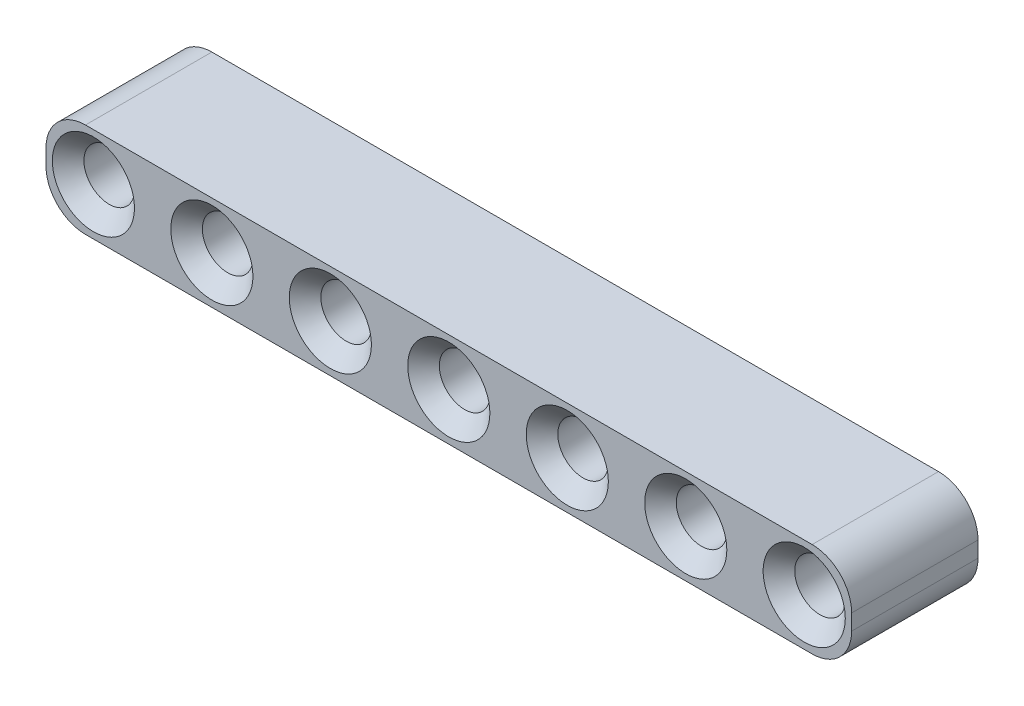
ISO-10303-21;
HEADER;
FILE_DESCRIPTION(('STEP AP214'),'2;1');
FILE_NAME('part.step','',(''),(''),'','','');
FILE_SCHEMA(('AUTOMOTIVE_DESIGN { 1 0 10303 214 1 1 1 1 }'));
ENDSEC;
DATA;
#1=APPLICATION_CONTEXT('core data for automotive mechanical design processes');
#2=APPLICATION_PROTOCOL_DEFINITION('international standard','automotive_design',2000,#1);
#3=PRODUCT_CONTEXT('',#1,'mechanical');
#4=PRODUCT('Part','Part','',(#3));
#5=PRODUCT_RELATED_PRODUCT_CATEGORY('part','',(#4));
#6=PRODUCT_DEFINITION_FORMATION('','',#4);
#7=PRODUCT_DEFINITION_CONTEXT('part definition',#1,'design');
#8=PRODUCT_DEFINITION('design','',#6,#7);
#9=PRODUCT_DEFINITION_SHAPE('','',#8);
#10=(LENGTH_UNIT() NAMED_UNIT(*) SI_UNIT(.MILLI.,.METRE.));
#11=(NAMED_UNIT(*) PLANE_ANGLE_UNIT() SI_UNIT($,.RADIAN.));
#12=(NAMED_UNIT(*) SI_UNIT($,.STERADIAN.) SOLID_ANGLE_UNIT());
#13=UNCERTAINTY_MEASURE_WITH_UNIT(LENGTH_MEASURE(1.E-05),#10,'distance_accuracy_value','');
#14=(GEOMETRIC_REPRESENTATION_CONTEXT(3) GLOBAL_UNCERTAINTY_ASSIGNED_CONTEXT((#13)) GLOBAL_UNIT_ASSIGNED_CONTEXT((#10,
#11,#12)) REPRESENTATION_CONTEXT('',''));
#15=CARTESIAN_POINT('',(0.,0.,0.));
#16=DIRECTION('',(0.,0.,1.));
#17=DIRECTION('',(1.,0.,0.));
#18=AXIS2_PLACEMENT_3D('',#15,#16,#17);
#19=CARTESIAN_POINT('',(45.5,-0.5,8.));
#20=DIRECTION('',(0.,0.,1.));
#21=DIRECTION('',(1.,0.,0.));
#22=AXIS2_PLACEMENT_3D('',#19,#20,#21);
#23=PLANE('',#22);
#24=CARTESIAN_POINT('',(45.,0.,8.));
#25=DIRECTION('',(0.,0.,1.));
#26=DIRECTION('',(1.,0.,0.));
#27=AXIS2_PLACEMENT_3D('',#24,#25,#26);
#28=CIRCLE('',#27,2.6);
#29=CARTESIAN_POINT('',(47.6,0.,8.));
#30=VERTEX_POINT('',#29);
#31=EDGE_CURVE('E204',#30,#30,#28,.F.);
#32=ORIENTED_EDGE('',*,*,#31,.T.);
#33=EDGE_LOOP('',(#32));
#34=FACE_BOUND('',#33,.T.);
#35=CARTESIAN_POINT('',(37.5,0.,8.));
#36=DIRECTION('',(0.,0.,1.));
#37=DIRECTION('',(1.,0.,0.));
#38=AXIS2_PLACEMENT_3D('',#35,#36,#37);
#39=CIRCLE('',#38,2.6);
#40=CARTESIAN_POINT('',(40.1,0.,8.));
#41=VERTEX_POINT('',#40);
#42=EDGE_CURVE('E201',#41,#41,#39,.F.);
#43=ORIENTED_EDGE('',*,*,#42,.T.);
#44=EDGE_LOOP('',(#43));
#45=FACE_BOUND('',#44,.T.);
#46=CARTESIAN_POINT('',(30.,0.,8.));
#47=DIRECTION('',(0.,0.,1.));
#48=DIRECTION('',(1.,0.,0.));
#49=AXIS2_PLACEMENT_3D('',#46,#47,#48);
#50=CIRCLE('',#49,2.6);
#51=CARTESIAN_POINT('',(32.6,0.,8.));
#52=VERTEX_POINT('',#51);
#53=EDGE_CURVE('E198',#52,#52,#50,.F.);
#54=ORIENTED_EDGE('',*,*,#53,.T.);
#55=EDGE_LOOP('',(#54));
#56=FACE_BOUND('',#55,.T.);
#57=CARTESIAN_POINT('',(22.5,0.,8.));
#58=DIRECTION('',(0.,0.,1.));
#59=DIRECTION('',(1.,0.,0.));
#60=AXIS2_PLACEMENT_3D('',#57,#58,#59);
#61=CIRCLE('',#60,2.6);
#62=CARTESIAN_POINT('',(25.1,0.,8.));
#63=VERTEX_POINT('',#62);
#64=EDGE_CURVE('E195',#63,#63,#61,.F.);
#65=ORIENTED_EDGE('',*,*,#64,.T.);
#66=EDGE_LOOP('',(#65));
#67=FACE_BOUND('',#66,.T.);
#68=CARTESIAN_POINT('',(15.,0.,8.));
#69=DIRECTION('',(0.,0.,1.));
#70=DIRECTION('',(1.,0.,0.));
#71=AXIS2_PLACEMENT_3D('',#68,#69,#70);
#72=CIRCLE('',#71,2.6);
#73=CARTESIAN_POINT('',(17.6,0.,8.));
#74=VERTEX_POINT('',#73);
#75=EDGE_CURVE('E192',#74,#74,#72,.F.);
#76=ORIENTED_EDGE('',*,*,#75,.T.);
#77=EDGE_LOOP('',(#76));
#78=FACE_BOUND('',#77,.T.);
#79=CARTESIAN_POINT('',(7.5,0.,8.));
#80=DIRECTION('',(0.,0.,1.));
#81=DIRECTION('',(1.,0.,0.));
#82=AXIS2_PLACEMENT_3D('',#79,#80,#81);
#83=CIRCLE('',#82,2.60000000000001);
#84=CARTESIAN_POINT('',(10.1,0.,8.));
#85=VERTEX_POINT('',#84);
#86=EDGE_CURVE('E189',#85,#85,#83,.F.);
#87=ORIENTED_EDGE('',*,*,#86,.T.);
#88=EDGE_LOOP('',(#87));
#89=FACE_BOUND('',#88,.T.);
#90=CARTESIAN_POINT('',(0.,0.,8.));
#91=DIRECTION('',(0.,0.,1.));
#92=DIRECTION('',(1.,0.,0.));
#93=AXIS2_PLACEMENT_3D('',#90,#91,#92);
#94=CIRCLE('',#93,2.60000000000001);
#95=CARTESIAN_POINT('',(2.60000000000001,0.,8.));
#96=VERTEX_POINT('',#95);
#97=EDGE_CURVE('E186',#96,#96,#94,.F.);
#98=ORIENTED_EDGE('',*,*,#97,.T.);
#99=EDGE_LOOP('',(#98));
#100=FACE_BOUND('',#99,.T.);
#101=CARTESIAN_POINT('',(45.5,-0.5,8.));
#102=DIRECTION('',(0.,0.,1.));
#103=DIRECTION('',(1.,0.,0.));
#104=AXIS2_PLACEMENT_3D('',#101,#102,#103);
#105=CIRCLE('',#104,2.5);
#106=CARTESIAN_POINT('',(45.5,-3.,8.));
#107=VERTEX_POINT('',#106);
#108=CARTESIAN_POINT('',(48.,-0.5,8.));
#109=VERTEX_POINT('',#108);
#110=EDGE_CURVE('E144',#107,#109,#105,.T.);
#111=ORIENTED_EDGE('',*,*,#110,.T.);
#112=DIRECTION('',(0.,1.,0.));
#113=VECTOR('',#112,1.);
#114=CARTESIAN_POINT('',(48.,0.5,8.));
#115=LINE('',#114,#113);
#116=CARTESIAN_POINT('',(48.,0.5,8.));
#117=VERTEX_POINT('',#116);
#118=EDGE_CURVE('E94',#109,#117,#115,.T.);
#119=ORIENTED_EDGE('',*,*,#118,.T.);
#120=CARTESIAN_POINT('',(45.5,0.5,8.));
#121=DIRECTION('',(0.,0.,1.));
#122=DIRECTION('',(-1.,0.,0.));
#123=AXIS2_PLACEMENT_3D('',#120,#121,#122);
#124=CIRCLE('',#123,2.5);
#125=CARTESIAN_POINT('',(45.5,3.,8.));
#126=VERTEX_POINT('',#125);
#127=EDGE_CURVE('E394',#117,#126,#124,.T.);
#128=ORIENTED_EDGE('',*,*,#127,.T.);
#129=DIRECTION('',(-1.,0.,0.));
#130=VECTOR('',#129,1.);
#131=CARTESIAN_POINT('',(-0.5,3.,8.));
#132=LINE('',#131,#130);
#133=CARTESIAN_POINT('',(-0.5,3.,8.));
#134=VERTEX_POINT('',#133);
#135=EDGE_CURVE('E398',#126,#134,#132,.T.);
#136=ORIENTED_EDGE('',*,*,#135,.T.);
#137=CARTESIAN_POINT('',(-0.5,0.5,8.));
#138=DIRECTION('',(0.,0.,1.));
#139=DIRECTION('',(1.,0.,0.));
#140=AXIS2_PLACEMENT_3D('',#137,#138,#139);
#141=CIRCLE('',#140,2.5);
#142=CARTESIAN_POINT('',(-3.,0.5,8.));
#143=VERTEX_POINT('',#142);
#144=EDGE_CURVE('E112',#134,#143,#141,.T.);
#145=ORIENTED_EDGE('',*,*,#144,.T.);
#146=DIRECTION('',(0.,-1.,0.));
#147=VECTOR('',#146,1.);
#148=CARTESIAN_POINT('',(-3.,0.5,8.));
#149=LINE('',#148,#147);
#150=CARTESIAN_POINT('',(-3.,-0.5,8.));
#151=VERTEX_POINT('',#150);
#152=EDGE_CURVE('E107',#143,#151,#149,.T.);
#153=ORIENTED_EDGE('',*,*,#152,.T.);
#154=CARTESIAN_POINT('',(-0.5,-0.5,8.));
#155=DIRECTION('',(0.,0.,1.));
#156=DIRECTION('',(1.,0.,0.));
#157=AXIS2_PLACEMENT_3D('',#154,#155,#156);
#158=CIRCLE('',#157,2.5);
#159=CARTESIAN_POINT('',(-0.5,-3.,8.));
#160=VERTEX_POINT('',#159);
#161=EDGE_CURVE('E110',#151,#160,#158,.T.);
#162=ORIENTED_EDGE('',*,*,#161,.T.);
#163=DIRECTION('',(1.,0.,0.));
#164=VECTOR('',#163,1.);
#165=CARTESIAN_POINT('',(-0.5,-3.,8.));
#166=LINE('',#165,#164);
#167=EDGE_CURVE('E50',#160,#107,#166,.T.);
#168=ORIENTED_EDGE('',*,*,#167,.T.);
#169=EDGE_LOOP('',(#111,#119,#128,#136,#145,#153,#162,#168));
#170=FACE_BOUND('',#169,.T.);
#171=ADVANCED_FACE('F33',(#34,#45,#56,#67,#78,#89,#100,#170),#23,.T.);
#172=CARTESIAN_POINT('',(45.5,-0.5,0.));
#173=DIRECTION('',(0.,0.,1.));
#174=DIRECTION('',(1.,0.,0.));
#175=AXIS2_PLACEMENT_3D('',#172,#173,#174);
#176=PLANE('',#175);
#177=CARTESIAN_POINT('',(45.,0.,0.));
#178=DIRECTION('',(0.,0.,1.));
#179=DIRECTION('',(1.,0.,0.));
#180=AXIS2_PLACEMENT_3D('',#177,#178,#179);
#181=CIRCLE('',#180,2.59999999999998);
#182=CARTESIAN_POINT('',(47.6,0.,0.));
#183=VERTEX_POINT('',#182);
#184=EDGE_CURVE('E177',#183,#183,#181,.T.);
#185=ORIENTED_EDGE('',*,*,#184,.T.);
#186=EDGE_LOOP('',(#185));
#187=FACE_BOUND('',#186,.T.);
#188=CARTESIAN_POINT('',(37.5,0.,0.));
#189=DIRECTION('',(0.,0.,1.));
#190=DIRECTION('',(1.,0.,0.));
#191=AXIS2_PLACEMENT_3D('',#188,#189,#190);
#192=CIRCLE('',#191,2.59999999999999);
#193=CARTESIAN_POINT('',(40.1,0.,0.));
#194=VERTEX_POINT('',#193);
#195=EDGE_CURVE('E174',#194,#194,#192,.T.);
#196=ORIENTED_EDGE('',*,*,#195,.T.);
#197=EDGE_LOOP('',(#196));
#198=FACE_BOUND('',#197,.T.);
#199=CARTESIAN_POINT('',(30.,0.,0.));
#200=DIRECTION('',(0.,0.,1.));
#201=DIRECTION('',(1.,0.,0.));
#202=AXIS2_PLACEMENT_3D('',#199,#200,#201);
#203=CIRCLE('',#202,2.6);
#204=CARTESIAN_POINT('',(32.6,0.,0.));
#205=VERTEX_POINT('',#204);
#206=EDGE_CURVE('E171',#205,#205,#203,.T.);
#207=ORIENTED_EDGE('',*,*,#206,.T.);
#208=EDGE_LOOP('',(#207));
#209=FACE_BOUND('',#208,.T.);
#210=CARTESIAN_POINT('',(22.5,0.,0.));
#211=DIRECTION('',(0.,0.,1.));
#212=DIRECTION('',(1.,0.,0.));
#213=AXIS2_PLACEMENT_3D('',#210,#211,#212);
#214=CIRCLE('',#213,2.6);
#215=CARTESIAN_POINT('',(25.1,0.,0.));
#216=VERTEX_POINT('',#215);
#217=EDGE_CURVE('E168',#216,#216,#214,.T.);
#218=ORIENTED_EDGE('',*,*,#217,.T.);
#219=EDGE_LOOP('',(#218));
#220=FACE_BOUND('',#219,.T.);
#221=CARTESIAN_POINT('',(15.,0.,0.));
#222=DIRECTION('',(0.,0.,1.));
#223=DIRECTION('',(1.,0.,0.));
#224=AXIS2_PLACEMENT_3D('',#221,#222,#223);
#225=CIRCLE('',#224,2.6);
#226=CARTESIAN_POINT('',(17.6,0.,0.));
#227=VERTEX_POINT('',#226);
#228=EDGE_CURVE('E165',#227,#227,#225,.T.);
#229=ORIENTED_EDGE('',*,*,#228,.T.);
#230=EDGE_LOOP('',(#229));
#231=FACE_BOUND('',#230,.T.);
#232=CARTESIAN_POINT('',(7.5,0.,0.));
#233=DIRECTION('',(0.,0.,1.));
#234=DIRECTION('',(1.,0.,0.));
#235=AXIS2_PLACEMENT_3D('',#232,#233,#234);
#236=CIRCLE('',#235,2.59999999999999);
#237=CARTESIAN_POINT('',(10.1,0.,0.));
#238=VERTEX_POINT('',#237);
#239=EDGE_CURVE('E162',#238,#238,#236,.T.);
#240=ORIENTED_EDGE('',*,*,#239,.T.);
#241=EDGE_LOOP('',(#240));
#242=FACE_BOUND('',#241,.T.);
#243=CARTESIAN_POINT('',(0.,0.,0.));
#244=DIRECTION('',(0.,0.,1.));
#245=DIRECTION('',(1.,0.,0.));
#246=AXIS2_PLACEMENT_3D('',#243,#244,#245);
#247=CIRCLE('',#246,2.59999999999999);
#248=CARTESIAN_POINT('',(2.59999999999999,0.,0.));
#249=VERTEX_POINT('',#248);
#250=EDGE_CURVE('E159',#249,#249,#247,.T.);
#251=ORIENTED_EDGE('',*,*,#250,.T.);
#252=EDGE_LOOP('',(#251));
#253=FACE_BOUND('',#252,.T.);
#254=CARTESIAN_POINT('',(45.5,-0.5,0.));
#255=DIRECTION('',(0.,0.,1.));
#256=DIRECTION('',(1.,0.,0.));
#257=AXIS2_PLACEMENT_3D('',#254,#255,#256);
#258=CIRCLE('',#257,2.5);
#259=CARTESIAN_POINT('',(45.5,-3.,0.));
#260=VERTEX_POINT('',#259);
#261=CARTESIAN_POINT('',(48.,-0.5,0.));
#262=VERTEX_POINT('',#261);
#263=EDGE_CURVE('E130',#260,#262,#258,.T.);
#264=ORIENTED_EDGE('',*,*,#263,.F.);
#265=DIRECTION('',(1.,0.,0.));
#266=VECTOR('',#265,1.);
#267=CARTESIAN_POINT('',(-0.5,-3.,0.));
#268=LINE('',#267,#266);
#269=CARTESIAN_POINT('',(-0.5,-3.,0.));
#270=VERTEX_POINT('',#269);
#271=EDGE_CURVE('E85',#270,#260,#268,.T.);
#272=ORIENTED_EDGE('',*,*,#271,.F.);
#273=CARTESIAN_POINT('',(-0.5,-0.5,0.));
#274=DIRECTION('',(0.,0.,1.));
#275=DIRECTION('',(1.,0.,0.));
#276=AXIS2_PLACEMENT_3D('',#273,#274,#275);
#277=CIRCLE('',#276,2.5);
#278=CARTESIAN_POINT('',(-3.,-0.5,0.));
#279=VERTEX_POINT('',#278);
#280=EDGE_CURVE('E79',#279,#270,#277,.T.);
#281=ORIENTED_EDGE('',*,*,#280,.F.);
#282=DIRECTION('',(0.,-1.,0.));
#283=VECTOR('',#282,1.);
#284=CARTESIAN_POINT('',(-3.,0.5,0.));
#285=LINE('',#284,#283);
#286=CARTESIAN_POINT('',(-3.,0.5,0.));
#287=VERTEX_POINT('',#286);
#288=EDGE_CURVE('E120',#287,#279,#285,.T.);
#289=ORIENTED_EDGE('',*,*,#288,.F.);
#290=CARTESIAN_POINT('',(-0.5,0.5,0.));
#291=DIRECTION('',(0.,0.,1.));
#292=DIRECTION('',(1.,0.,0.));
#293=AXIS2_PLACEMENT_3D('',#290,#291,#292);
#294=CIRCLE('',#293,2.5);
#295=CARTESIAN_POINT('',(-0.5,3.,0.));
#296=VERTEX_POINT('',#295);
#297=EDGE_CURVE('E139',#296,#287,#294,.T.);
#298=ORIENTED_EDGE('',*,*,#297,.F.);
#299=DIRECTION('',(-1.,0.,0.));
#300=VECTOR('',#299,1.);
#301=CARTESIAN_POINT('',(-0.5,3.,0.));
#302=LINE('',#301,#300);
#303=CARTESIAN_POINT('',(45.5,3.,0.));
#304=VERTEX_POINT('',#303);
#305=EDGE_CURVE('E137',#304,#296,#302,.T.);
#306=ORIENTED_EDGE('',*,*,#305,.F.);
#307=CARTESIAN_POINT('',(45.5,0.5,0.));
#308=DIRECTION('',(0.,0.,1.));
#309=DIRECTION('',(-1.,0.,0.));
#310=AXIS2_PLACEMENT_3D('',#307,#308,#309);
#311=CIRCLE('',#310,2.5);
#312=CARTESIAN_POINT('',(48.,0.5,0.));
#313=VERTEX_POINT('',#312);
#314=EDGE_CURVE('E135',#313,#304,#311,.T.);
#315=ORIENTED_EDGE('',*,*,#314,.F.);
#316=DIRECTION('',(0.,1.,0.));
#317=VECTOR('',#316,1.);
#318=CARTESIAN_POINT('',(48.,0.5,0.));
#319=LINE('',#318,#317);
#320=EDGE_CURVE('E133',#262,#313,#319,.T.);
#321=ORIENTED_EDGE('',*,*,#320,.F.);
#322=EDGE_LOOP('',(#264,#272,#281,#289,#298,#306,#315,#321));
#323=FACE_BOUND('',#322,.T.);
#324=ADVANCED_FACE('F251',(#187,#198,#209,#220,#231,#242,#253,#323),#176,.F.);
#325=CARTESIAN_POINT('',(45.5,-0.5,8.));
#326=DIRECTION('',(0.,0.,-1.));
#327=DIRECTION('',(-1.,0.,0.));
#328=AXIS2_PLACEMENT_3D('',#325,#326,#327);
#329=CYLINDRICAL_SURFACE('',#328,2.5);
#330=ORIENTED_EDGE('',*,*,#263,.T.);
#331=DIRECTION('',(0.,0.,-1.));
#332=VECTOR('',#331,1.);
#333=CARTESIAN_POINT('',(48.,-0.5,8.));
#334=LINE('',#333,#332);
#335=EDGE_CURVE('E157',#109,#262,#334,.T.);
#336=ORIENTED_EDGE('',*,*,#335,.F.);
#337=ORIENTED_EDGE('',*,*,#110,.F.);
#338=DIRECTION('',(0.,0.,-1.));
#339=VECTOR('',#338,1.);
#340=CARTESIAN_POINT('',(45.5,-3.,8.));
#341=LINE('',#340,#339);
#342=EDGE_CURVE('E126',#107,#260,#341,.T.);
#343=ORIENTED_EDGE('',*,*,#342,.T.);
#344=EDGE_LOOP('',(#330,#336,#337,#343));
#345=FACE_BOUND('',#344,.T.);
#346=ADVANCED_FACE('F257',(#345),#329,.T.);
#347=CARTESIAN_POINT('',(48.,0.5,8.));
#348=DIRECTION('',(-1.,0.,0.));
#349=DIRECTION('',(0.,0.,1.));
#350=AXIS2_PLACEMENT_3D('',#347,#348,#349);
#351=PLANE('',#350);
#352=ORIENTED_EDGE('',*,*,#320,.T.);
#353=DIRECTION('',(0.,0.,-1.));
#354=VECTOR('',#353,1.);
#355=CARTESIAN_POINT('',(48.,0.5,8.));
#356=LINE('',#355,#354);
#357=EDGE_CURVE('E154',#117,#313,#356,.T.);
#358=ORIENTED_EDGE('',*,*,#357,.F.);
#359=ORIENTED_EDGE('',*,*,#118,.F.);
#360=ORIENTED_EDGE('',*,*,#335,.T.);
#361=EDGE_LOOP('',(#352,#358,#359,#360));
#362=FACE_BOUND('',#361,.T.);
#363=ADVANCED_FACE('F282',(#362),#351,.F.);
#364=CARTESIAN_POINT('',(45.5,0.5,8.));
#365=DIRECTION('',(0.,0.,-1.));
#366=DIRECTION('',(-1.,0.,0.));
#367=AXIS2_PLACEMENT_3D('',#364,#365,#366);
#368=CYLINDRICAL_SURFACE('',#367,2.5);
#369=ORIENTED_EDGE('',*,*,#314,.T.);
#370=DIRECTION('',(0.,0.,-1.));
#371=VECTOR('',#370,1.);
#372=CARTESIAN_POINT('',(45.5,3.,8.));
#373=LINE('',#372,#371);
#374=EDGE_CURVE('E151',#126,#304,#373,.T.);
#375=ORIENTED_EDGE('',*,*,#374,.F.);
#376=ORIENTED_EDGE('',*,*,#127,.F.);
#377=ORIENTED_EDGE('',*,*,#357,.T.);
#378=EDGE_LOOP('',(#369,#375,#376,#377));
#379=FACE_BOUND('',#378,.T.);
#380=ADVANCED_FACE('F278',(#379),#368,.T.);
#381=CARTESIAN_POINT('',(-0.5,3.,8.));
#382=DIRECTION('',(0.,-1.,0.));
#383=DIRECTION('',(1.,0.,0.));
#384=AXIS2_PLACEMENT_3D('',#381,#382,#383);
#385=PLANE('',#384);
#386=ORIENTED_EDGE('',*,*,#305,.T.);
#387=DIRECTION('',(0.,0.,-1.));
#388=VECTOR('',#387,1.);
#389=CARTESIAN_POINT('',(-0.5,3.,8.));
#390=LINE('',#389,#388);
#391=EDGE_CURVE('E148',#134,#296,#390,.T.);
#392=ORIENTED_EDGE('',*,*,#391,.F.);
#393=ORIENTED_EDGE('',*,*,#135,.F.);
#394=ORIENTED_EDGE('',*,*,#374,.T.);
#395=EDGE_LOOP('',(#386,#392,#393,#394));
#396=FACE_BOUND('',#395,.T.);
#397=ADVANCED_FACE('F274',(#396),#385,.F.);
#398=CARTESIAN_POINT('',(-0.5,0.5,8.));
#399=DIRECTION('',(0.,0.,-1.));
#400=DIRECTION('',(-1.,0.,0.));
#401=AXIS2_PLACEMENT_3D('',#398,#399,#400);
#402=CYLINDRICAL_SURFACE('',#401,2.5);
#403=ORIENTED_EDGE('',*,*,#297,.T.);
#404=DIRECTION('',(0.,0.,-1.));
#405=VECTOR('',#404,1.);
#406=CARTESIAN_POINT('',(-3.,0.5,8.));
#407=LINE('',#406,#405);
#408=EDGE_CURVE('E121',#143,#287,#407,.T.);
#409=ORIENTED_EDGE('',*,*,#408,.F.);
#410=ORIENTED_EDGE('',*,*,#144,.F.);
#411=ORIENTED_EDGE('',*,*,#391,.T.);
#412=EDGE_LOOP('',(#403,#409,#410,#411));
#413=FACE_BOUND('',#412,.T.);
#414=ADVANCED_FACE('F271',(#413),#402,.T.);
#415=CARTESIAN_POINT('',(-3.,0.5,8.));
#416=DIRECTION('',(1.,0.,0.));
#417=DIRECTION('',(0.,0.,-1.));
#418=AXIS2_PLACEMENT_3D('',#415,#416,#417);
#419=PLANE('',#418);
#420=ORIENTED_EDGE('',*,*,#288,.T.);
#421=DIRECTION('',(0.,0.,-1.));
#422=VECTOR('',#421,1.);
#423=CARTESIAN_POINT('',(-3.,-0.5,8.));
#424=LINE('',#423,#422);
#425=EDGE_CURVE('E117',#151,#279,#424,.T.);
#426=ORIENTED_EDGE('',*,*,#425,.F.);
#427=ORIENTED_EDGE('',*,*,#152,.F.);
#428=ORIENTED_EDGE('',*,*,#408,.T.);
#429=EDGE_LOOP('',(#420,#426,#427,#428));
#430=FACE_BOUND('',#429,.T.);
#431=ADVANCED_FACE('F118',(#430),#419,.F.);
#432=CARTESIAN_POINT('',(-0.5,-0.5,8.));
#433=DIRECTION('',(0.,0.,-1.));
#434=DIRECTION('',(-1.,0.,0.));
#435=AXIS2_PLACEMENT_3D('',#432,#433,#434);
#436=CYLINDRICAL_SURFACE('',#435,2.5);
#437=ORIENTED_EDGE('',*,*,#280,.T.);
#438=DIRECTION('',(0.,0.,-1.));
#439=VECTOR('',#438,1.);
#440=CARTESIAN_POINT('',(-0.5,-3.,8.));
#441=LINE('',#440,#439);
#442=EDGE_CURVE('E122',#160,#270,#441,.T.);
#443=ORIENTED_EDGE('',*,*,#442,.F.);
#444=ORIENTED_EDGE('',*,*,#161,.F.);
#445=ORIENTED_EDGE('',*,*,#425,.T.);
#446=EDGE_LOOP('',(#437,#443,#444,#445));
#447=FACE_BOUND('',#446,.T.);
#448=ADVANCED_FACE('F124',(#447),#436,.T.);
#449=CARTESIAN_POINT('',(-0.5,-3.,8.));
#450=DIRECTION('',(0.,1.,0.));
#451=DIRECTION('',(-1.,0.,0.));
#452=AXIS2_PLACEMENT_3D('',#449,#450,#451);
#453=PLANE('',#452);
#454=ORIENTED_EDGE('',*,*,#271,.T.);
#455=ORIENTED_EDGE('',*,*,#342,.F.);
#456=ORIENTED_EDGE('',*,*,#167,.F.);
#457=ORIENTED_EDGE('',*,*,#442,.T.);
#458=EDGE_LOOP('',(#454,#455,#456,#457));
#459=FACE_BOUND('',#458,.T.);
#460=ADVANCED_FACE('F264',(#459),#453,.F.);
#461=CARTESIAN_POINT('',(0.,0.,8.));
#462=DIRECTION('',(0.,0.,-1.));
#463=DIRECTION('',(-1.,0.,0.));
#464=AXIS2_PLACEMENT_3D('',#461,#462,#463);
#465=CYLINDRICAL_SURFACE('',#464,1.6);
#466=CARTESIAN_POINT('',(0.,0.,0.999999999999992));
#467=DIRECTION('',(0.,0.,1.));
#468=DIRECTION('',(1.,0.,0.));
#469=AXIS2_PLACEMENT_3D('',#466,#467,#468);
#470=CIRCLE('',#469,1.6);
#471=CARTESIAN_POINT('',(1.6,0.,0.999999999999992));
#472=VERTEX_POINT('',#471);
#473=EDGE_CURVE('E11',#472,#472,#470,.F.);
#474=ORIENTED_EDGE('',*,*,#473,.T.);
#475=EDGE_LOOP('',(#474));
#476=FACE_BOUND('',#475,.T.);
#477=CARTESIAN_POINT('',(0.,0.,7.));
#478=DIRECTION('',(0.,0.,1.));
#479=DIRECTION('',(1.,0.,0.));
#480=AXIS2_PLACEMENT_3D('',#477,#478,#479);
#481=CIRCLE('',#480,1.6);
#482=CARTESIAN_POINT('',(1.6,0.,7.));
#483=VERTEX_POINT('',#482);
#484=EDGE_CURVE('E42',#483,#483,#481,.T.);
#485=ORIENTED_EDGE('',*,*,#484,.T.);
#486=EDGE_LOOP('',(#485));
#487=FACE_BOUND('',#486,.T.);
#488=ADVANCED_FACE('F239',(#476,#487),#465,.F.);
#489=CARTESIAN_POINT('',(7.5,0.,8.));
#490=DIRECTION('',(0.,0.,-1.));
#491=DIRECTION('',(-1.,0.,0.));
#492=AXIS2_PLACEMENT_3D('',#489,#490,#491);
#493=CYLINDRICAL_SURFACE('',#492,1.6);
#494=CARTESIAN_POINT('',(7.5,0.,0.99999999999999));
#495=DIRECTION('',(0.,0.,1.));
#496=DIRECTION('',(1.,0.,0.));
#497=AXIS2_PLACEMENT_3D('',#494,#495,#496);
#498=CIRCLE('',#497,1.6);
#499=CARTESIAN_POINT('',(9.1,0.,0.99999999999999));
#500=VERTEX_POINT('',#499);
#501=EDGE_CURVE('E234',#500,#500,#498,.F.);
#502=ORIENTED_EDGE('',*,*,#501,.T.);
#503=EDGE_LOOP('',(#502));
#504=FACE_BOUND('',#503,.T.);
#505=CARTESIAN_POINT('',(7.5,0.,7.));
#506=DIRECTION('',(0.,0.,1.));
#507=DIRECTION('',(1.,0.,0.));
#508=AXIS2_PLACEMENT_3D('',#505,#506,#507);
#509=CIRCLE('',#508,1.6);
#510=CARTESIAN_POINT('',(9.1,0.,7.));
#511=VERTEX_POINT('',#510);
#512=EDGE_CURVE('E231',#511,#511,#509,.T.);
#513=ORIENTED_EDGE('',*,*,#512,.T.);
#514=EDGE_LOOP('',(#513));
#515=FACE_BOUND('',#514,.T.);
#516=ADVANCED_FACE('F342',(#504,#515),#493,.F.);
#517=CARTESIAN_POINT('',(15.,0.,8.));
#518=DIRECTION('',(0.,0.,-1.));
#519=DIRECTION('',(-1.,0.,0.));
#520=AXIS2_PLACEMENT_3D('',#517,#518,#519);
#521=CYLINDRICAL_SURFACE('',#520,1.6);
#522=CARTESIAN_POINT('',(15.,0.,1.00000000000001));
#523=DIRECTION('',(0.,0.,1.));
#524=DIRECTION('',(1.,0.,0.));
#525=AXIS2_PLACEMENT_3D('',#522,#523,#524);
#526=CIRCLE('',#525,1.6);
#527=CARTESIAN_POINT('',(16.6,0.,1.00000000000001));
#528=VERTEX_POINT('',#527);
#529=EDGE_CURVE('E228',#528,#528,#526,.F.);
#530=ORIENTED_EDGE('',*,*,#529,.T.);
#531=EDGE_LOOP('',(#530));
#532=FACE_BOUND('',#531,.T.);
#533=CARTESIAN_POINT('',(15.,0.,7.));
#534=DIRECTION('',(0.,0.,1.));
#535=DIRECTION('',(1.,0.,0.));
#536=AXIS2_PLACEMENT_3D('',#533,#534,#535);
#537=CIRCLE('',#536,1.6);
#538=CARTESIAN_POINT('',(16.6,0.,7.));
#539=VERTEX_POINT('',#538);
#540=EDGE_CURVE('E225',#539,#539,#537,.T.);
#541=ORIENTED_EDGE('',*,*,#540,.T.);
#542=EDGE_LOOP('',(#541));
#543=FACE_BOUND('',#542,.T.);
#544=ADVANCED_FACE('F344',(#532,#543),#521,.F.);
#545=CARTESIAN_POINT('',(22.5,0.,8.));
#546=DIRECTION('',(0.,0.,-1.));
#547=DIRECTION('',(-1.,0.,0.));
#548=AXIS2_PLACEMENT_3D('',#545,#546,#547);
#549=CYLINDRICAL_SURFACE('',#548,1.6);
#550=CARTESIAN_POINT('',(22.5,0.,1.00000000000001));
#551=DIRECTION('',(0.,0.,1.));
#552=DIRECTION('',(1.,0.,0.));
#553=AXIS2_PLACEMENT_3D('',#550,#551,#552);
#554=CIRCLE('',#553,1.6);
#555=CARTESIAN_POINT('',(24.1,0.,1.00000000000001));
#556=VERTEX_POINT('',#555);
#557=EDGE_CURVE('E222',#556,#556,#554,.F.);
#558=ORIENTED_EDGE('',*,*,#557,.T.);
#559=EDGE_LOOP('',(#558));
#560=FACE_BOUND('',#559,.T.);
#561=CARTESIAN_POINT('',(22.5,0.,7.));
#562=DIRECTION('',(0.,0.,1.));
#563=DIRECTION('',(1.,0.,0.));
#564=AXIS2_PLACEMENT_3D('',#561,#562,#563);
#565=CIRCLE('',#564,1.6);
#566=CARTESIAN_POINT('',(24.1,0.,7.));
#567=VERTEX_POINT('',#566);
#568=EDGE_CURVE('E219',#567,#567,#565,.T.);
#569=ORIENTED_EDGE('',*,*,#568,.T.);
#570=EDGE_LOOP('',(#569));
#571=FACE_BOUND('',#570,.T.);
#572=ADVANCED_FACE('F350',(#560,#571),#549,.F.);
#573=CARTESIAN_POINT('',(30.,0.,8.));
#574=DIRECTION('',(0.,0.,-1.));
#575=DIRECTION('',(-1.,0.,0.));
#576=AXIS2_PLACEMENT_3D('',#573,#574,#575);
#577=CYLINDRICAL_SURFACE('',#576,1.6);
#578=CARTESIAN_POINT('',(30.,0.,1.00000000000001));
#579=DIRECTION('',(0.,0.,1.));
#580=DIRECTION('',(1.,0.,0.));
#581=AXIS2_PLACEMENT_3D('',#578,#579,#580);
#582=CIRCLE('',#581,1.6);
#583=CARTESIAN_POINT('',(31.6,0.,1.00000000000001));
#584=VERTEX_POINT('',#583);
#585=EDGE_CURVE('E216',#584,#584,#582,.F.);
#586=ORIENTED_EDGE('',*,*,#585,.T.);
#587=EDGE_LOOP('',(#586));
#588=FACE_BOUND('',#587,.T.);
#589=CARTESIAN_POINT('',(30.,0.,7.));
#590=DIRECTION('',(0.,0.,1.));
#591=DIRECTION('',(1.,0.,0.));
#592=AXIS2_PLACEMENT_3D('',#589,#590,#591);
#593=CIRCLE('',#592,1.6);
#594=CARTESIAN_POINT('',(31.6,0.,7.));
#595=VERTEX_POINT('',#594);
#596=EDGE_CURVE('E213',#595,#595,#593,.T.);
#597=ORIENTED_EDGE('',*,*,#596,.T.);
#598=EDGE_LOOP('',(#597));
#599=FACE_BOUND('',#598,.T.);
#600=ADVANCED_FACE('F357',(#588,#599),#577,.F.);
#601=CARTESIAN_POINT('',(37.5,0.,8.));
#602=DIRECTION('',(0.,0.,-1.));
#603=DIRECTION('',(-1.,0.,0.));
#604=AXIS2_PLACEMENT_3D('',#601,#602,#603);
#605=CYLINDRICAL_SURFACE('',#604,1.6);
#606=CARTESIAN_POINT('',(37.5,0.,1.));
#607=DIRECTION('',(0.,0.,1.));
#608=DIRECTION('',(1.,0.,0.));
#609=AXIS2_PLACEMENT_3D('',#606,#607,#608);
#610=CIRCLE('',#609,1.6);
#611=CARTESIAN_POINT('',(39.1,0.,1.));
#612=VERTEX_POINT('',#611);
#613=EDGE_CURVE('E210',#612,#612,#610,.F.);
#614=ORIENTED_EDGE('',*,*,#613,.T.);
#615=EDGE_LOOP('',(#614));
#616=FACE_BOUND('',#615,.T.);
#617=CARTESIAN_POINT('',(37.5,0.,7.));
#618=DIRECTION('',(0.,0.,1.));
#619=DIRECTION('',(1.,0.,0.));
#620=AXIS2_PLACEMENT_3D('',#617,#618,#619);
#621=CIRCLE('',#620,1.6);
#622=CARTESIAN_POINT('',(39.1,0.,7.));
#623=VERTEX_POINT('',#622);
#624=EDGE_CURVE('E207',#623,#623,#621,.T.);
#625=ORIENTED_EDGE('',*,*,#624,.T.);
#626=EDGE_LOOP('',(#625));
#627=FACE_BOUND('',#626,.T.);
#628=ADVANCED_FACE('F361',(#616,#627),#605,.F.);
#629=CARTESIAN_POINT('',(45.,0.,8.));
#630=DIRECTION('',(0.,0.,-1.));
#631=DIRECTION('',(-1.,0.,0.));
#632=AXIS2_PLACEMENT_3D('',#629,#630,#631);
#633=CYLINDRICAL_SURFACE('',#632,1.6);
#634=CARTESIAN_POINT('',(45.,0.,0.999999999999997));
#635=DIRECTION('',(0.,0.,1.));
#636=DIRECTION('',(1.,0.,0.));
#637=AXIS2_PLACEMENT_3D('',#634,#635,#636);
#638=CIRCLE('',#637,1.6);
#639=CARTESIAN_POINT('',(46.6,0.,0.999999999999997));
#640=VERTEX_POINT('',#639);
#641=EDGE_CURVE('E183',#640,#640,#638,.F.);
#642=ORIENTED_EDGE('',*,*,#641,.T.);
#643=EDGE_LOOP('',(#642));
#644=FACE_BOUND('',#643,.T.);
#645=CARTESIAN_POINT('',(45.,0.,7.));
#646=DIRECTION('',(0.,0.,1.));
#647=DIRECTION('',(1.,0.,0.));
#648=AXIS2_PLACEMENT_3D('',#645,#646,#647);
#649=CIRCLE('',#648,1.6);
#650=CARTESIAN_POINT('',(46.6,0.,7.));
#651=VERTEX_POINT('',#650);
#652=EDGE_CURVE('E180',#651,#651,#649,.T.);
#653=ORIENTED_EDGE('',*,*,#652,.T.);
#654=EDGE_LOOP('',(#653));
#655=FACE_BOUND('',#654,.T.);
#656=ADVANCED_FACE('F293',(#644,#655),#633,.F.);
#657=CARTESIAN_POINT('',(45.,0.,0.));
#658=DIRECTION('',(0.,0.,-1.));
#659=DIRECTION('',(-1.,0.,0.));
#660=AXIS2_PLACEMENT_3D('',#657,#658,#659);
#661=CONICAL_SURFACE('',#660,2.59999999999998,0.785398163397443);
#662=ORIENTED_EDGE('',*,*,#641,.F.);
#663=EDGE_LOOP('',(#662));
#664=FACE_BOUND('',#663,.T.);
#665=ORIENTED_EDGE('',*,*,#184,.F.);
#666=EDGE_LOOP('',(#665));
#667=FACE_BOUND('',#666,.T.);
#668=ADVANCED_FACE('F289',(#664,#667),#661,.F.);
#669=CARTESIAN_POINT('',(45.,0.,7.));
#670=DIRECTION('',(0.,0.,1.));
#671=DIRECTION('',(1.,0.,0.));
#672=AXIS2_PLACEMENT_3D('',#669,#670,#671);
#673=CONICAL_SURFACE('',#672,1.6,0.785398163397449);
#674=ORIENTED_EDGE('',*,*,#31,.F.);
#675=EDGE_LOOP('',(#674));
#676=FACE_BOUND('',#675,.T.);
#677=ORIENTED_EDGE('',*,*,#652,.F.);
#678=EDGE_LOOP('',(#677));
#679=FACE_BOUND('',#678,.T.);
#680=ADVANCED_FACE('F292',(#676,#679),#673,.F.);
#681=CARTESIAN_POINT('',(37.5,0.,0.));
#682=DIRECTION('',(0.,0.,-1.));
#683=DIRECTION('',(-1.,0.,0.));
#684=AXIS2_PLACEMENT_3D('',#681,#682,#683);
#685=CONICAL_SURFACE('',#684,2.59999999999999,0.785398163397443);
#686=ORIENTED_EDGE('',*,*,#613,.F.);
#687=EDGE_LOOP('',(#686));
#688=FACE_BOUND('',#687,.T.);
#689=ORIENTED_EDGE('',*,*,#195,.F.);
#690=EDGE_LOOP('',(#689));
#691=FACE_BOUND('',#690,.T.);
#692=ADVANCED_FACE('F297',(#688,#691),#685,.F.);
#693=CARTESIAN_POINT('',(37.5,0.,7.));
#694=DIRECTION('',(0.,0.,1.));
#695=DIRECTION('',(1.,0.,0.));
#696=AXIS2_PLACEMENT_3D('',#693,#694,#695);
#697=CONICAL_SURFACE('',#696,1.6,0.785398163397449);
#698=ORIENTED_EDGE('',*,*,#42,.F.);
#699=EDGE_LOOP('',(#698));
#700=FACE_BOUND('',#699,.T.);
#701=ORIENTED_EDGE('',*,*,#624,.F.);
#702=EDGE_LOOP('',(#701));
#703=FACE_BOUND('',#702,.T.);
#704=ADVANCED_FACE('F301',(#700,#703),#697,.F.);
#705=CARTESIAN_POINT('',(30.,0.,0.));
#706=DIRECTION('',(0.,0.,-1.));
#707=DIRECTION('',(-1.,0.,0.));
#708=AXIS2_PLACEMENT_3D('',#705,#706,#707);
#709=CONICAL_SURFACE('',#708,2.6,0.785398163397444);
#710=ORIENTED_EDGE('',*,*,#585,.F.);
#711=EDGE_LOOP('',(#710));
#712=FACE_BOUND('',#711,.T.);
#713=ORIENTED_EDGE('',*,*,#206,.F.);
#714=EDGE_LOOP('',(#713));
#715=FACE_BOUND('',#714,.T.);
#716=ADVANCED_FACE('F305',(#712,#715),#709,.F.);
#717=CARTESIAN_POINT('',(30.,0.,7.));
#718=DIRECTION('',(0.,0.,1.));
#719=DIRECTION('',(1.,0.,0.));
#720=AXIS2_PLACEMENT_3D('',#717,#718,#719);
#721=CONICAL_SURFACE('',#720,1.6,0.785398163397449);
#722=ORIENTED_EDGE('',*,*,#53,.F.);
#723=EDGE_LOOP('',(#722));
#724=FACE_BOUND('',#723,.T.);
#725=ORIENTED_EDGE('',*,*,#596,.F.);
#726=EDGE_LOOP('',(#725));
#727=FACE_BOUND('',#726,.T.);
#728=ADVANCED_FACE('F309',(#724,#727),#721,.F.);
#729=CARTESIAN_POINT('',(22.5,0.,0.));
#730=DIRECTION('',(0.,0.,-1.));
#731=DIRECTION('',(-1.,0.,0.));
#732=AXIS2_PLACEMENT_3D('',#729,#730,#731);
#733=CONICAL_SURFACE('',#732,2.6,0.785398163397444);
#734=ORIENTED_EDGE('',*,*,#557,.F.);
#735=EDGE_LOOP('',(#734));
#736=FACE_BOUND('',#735,.T.);
#737=ORIENTED_EDGE('',*,*,#217,.F.);
#738=EDGE_LOOP('',(#737));
#739=FACE_BOUND('',#738,.T.);
#740=ADVANCED_FACE('F313',(#736,#739),#733,.F.);
#741=CARTESIAN_POINT('',(22.5,0.,7.));
#742=DIRECTION('',(0.,0.,1.));
#743=DIRECTION('',(1.,0.,0.));
#744=AXIS2_PLACEMENT_3D('',#741,#742,#743);
#745=CONICAL_SURFACE('',#744,1.6,0.785398163397449);
#746=ORIENTED_EDGE('',*,*,#64,.F.);
#747=EDGE_LOOP('',(#746));
#748=FACE_BOUND('',#747,.T.);
#749=ORIENTED_EDGE('',*,*,#568,.F.);
#750=EDGE_LOOP('',(#749));
#751=FACE_BOUND('',#750,.T.);
#752=ADVANCED_FACE('F317',(#748,#751),#745,.F.);
#753=CARTESIAN_POINT('',(15.,0.,0.));
#754=DIRECTION('',(0.,0.,-1.));
#755=DIRECTION('',(-1.,0.,0.));
#756=AXIS2_PLACEMENT_3D('',#753,#754,#755);
#757=CONICAL_SURFACE('',#756,2.6,0.785398163397444);
#758=ORIENTED_EDGE('',*,*,#529,.F.);
#759=EDGE_LOOP('',(#758));
#760=FACE_BOUND('',#759,.T.);
#761=ORIENTED_EDGE('',*,*,#228,.F.);
#762=EDGE_LOOP('',(#761));
#763=FACE_BOUND('',#762,.T.);
#764=ADVANCED_FACE('F321',(#760,#763),#757,.F.);
#765=CARTESIAN_POINT('',(15.,0.,7.));
#766=DIRECTION('',(0.,0.,1.));
#767=DIRECTION('',(1.,0.,0.));
#768=AXIS2_PLACEMENT_3D('',#765,#766,#767);
#769=CONICAL_SURFACE('',#768,1.6,0.785398163397449);
#770=ORIENTED_EDGE('',*,*,#75,.F.);
#771=EDGE_LOOP('',(#770));
#772=FACE_BOUND('',#771,.T.);
#773=ORIENTED_EDGE('',*,*,#540,.F.);
#774=EDGE_LOOP('',(#773));
#775=FACE_BOUND('',#774,.T.);
#776=ADVANCED_FACE('F325',(#772,#775),#769,.F.);
#777=CARTESIAN_POINT('',(7.5,0.,0.));
#778=DIRECTION('',(0.,0.,-1.));
#779=DIRECTION('',(-1.,0.,0.));
#780=AXIS2_PLACEMENT_3D('',#777,#778,#779);
#781=CONICAL_SURFACE('',#780,2.59999999999999,0.785398163397448);
#782=ORIENTED_EDGE('',*,*,#501,.F.);
#783=EDGE_LOOP('',(#782));
#784=FACE_BOUND('',#783,.T.);
#785=ORIENTED_EDGE('',*,*,#239,.F.);
#786=EDGE_LOOP('',(#785));
#787=FACE_BOUND('',#786,.T.);
#788=ADVANCED_FACE('F329',(#784,#787),#781,.F.);
#789=CARTESIAN_POINT('',(7.5,0.,7.));
#790=DIRECTION('',(0.,0.,1.));
#791=DIRECTION('',(1.,0.,0.));
#792=AXIS2_PLACEMENT_3D('',#789,#790,#791);
#793=CONICAL_SURFACE('',#792,1.6,0.785398163397452);
#794=ORIENTED_EDGE('',*,*,#86,.F.);
#795=EDGE_LOOP('',(#794));
#796=FACE_BOUND('',#795,.T.);
#797=ORIENTED_EDGE('',*,*,#512,.F.);
#798=EDGE_LOOP('',(#797));
#799=FACE_BOUND('',#798,.T.);
#800=ADVANCED_FACE('F247',(#796,#799),#793,.F.);
#801=CARTESIAN_POINT('',(0.,0.,0.));
#802=DIRECTION('',(0.,0.,-1.));
#803=DIRECTION('',(-1.,0.,0.));
#804=AXIS2_PLACEMENT_3D('',#801,#802,#803);
#805=CONICAL_SURFACE('',#804,2.59999999999999,0.785398163397448);
#806=ORIENTED_EDGE('',*,*,#473,.F.);
#807=EDGE_LOOP('',(#806));
#808=FACE_BOUND('',#807,.T.);
#809=ORIENTED_EDGE('',*,*,#250,.F.);
#810=EDGE_LOOP('',(#809));
#811=FACE_BOUND('',#810,.T.);
#812=ADVANCED_FACE('F242',(#808,#811),#805,.F.);
#813=CARTESIAN_POINT('',(0.,0.,7.));
#814=DIRECTION('',(0.,0.,1.));
#815=DIRECTION('',(1.,0.,0.));
#816=AXIS2_PLACEMENT_3D('',#813,#814,#815);
#817=CONICAL_SURFACE('',#816,1.6,0.785398163397452);
#818=ORIENTED_EDGE('',*,*,#97,.F.);
#819=EDGE_LOOP('',(#818));
#820=FACE_BOUND('',#819,.T.);
#821=ORIENTED_EDGE('',*,*,#484,.F.);
#822=EDGE_LOOP('',(#821));
#823=FACE_BOUND('',#822,.T.);
#824=ADVANCED_FACE('F35',(#820,#823),#817,.F.);
#825=CLOSED_SHELL('',(#171,#324,#346,#363,#380,#397,#414,#431,#448,#460,#488,#516,#544,#572,
#600,#628,#656,#668,#680,#692,#704,#716,#728,#740,#752,#764,#776,#788,#800,#812,#824));
#826=MANIFOLD_SOLID_BREP('B2',#825);
#827=ADVANCED_BREP_SHAPE_REPRESENTATION('',(#18,#826),#14);
#828=SHAPE_DEFINITION_REPRESENTATION(#9,#827);
ENDSEC;
END-ISO-10303-21;
